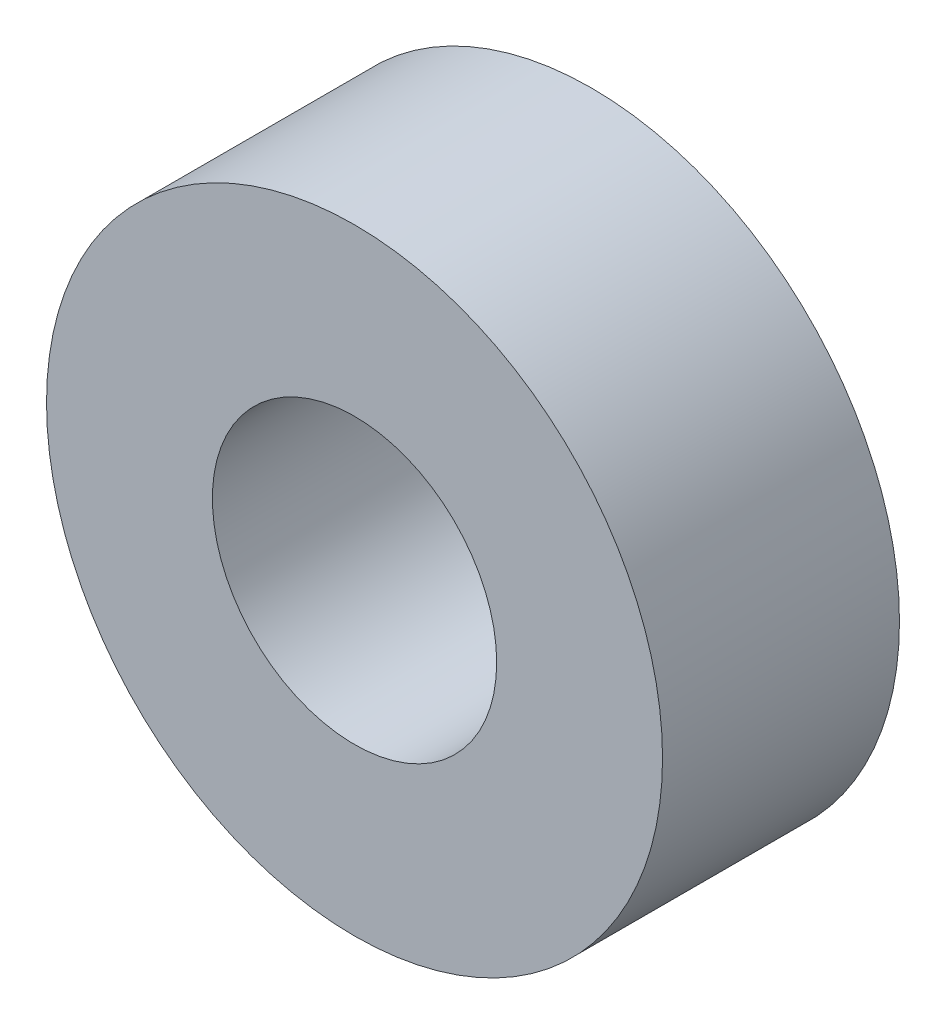
ISO-10303-21;
HEADER;
FILE_DESCRIPTION(('STEP AP214'),'2;1');
FILE_NAME('part.step','',(''),(''),'','','');
FILE_SCHEMA(('AUTOMOTIVE_DESIGN { 1 0 10303 214 1 1 1 1 }'));
ENDSEC;
DATA;
#1=APPLICATION_CONTEXT('core data for automotive mechanical design processes');
#2=APPLICATION_PROTOCOL_DEFINITION('international standard','automotive_design',2000,#1);
#3=PRODUCT_CONTEXT('',#1,'mechanical');
#4=PRODUCT('Part','Part','',(#3));
#5=PRODUCT_RELATED_PRODUCT_CATEGORY('part','',(#4));
#6=PRODUCT_DEFINITION_FORMATION('','',#4);
#7=PRODUCT_DEFINITION_CONTEXT('part definition',#1,'design');
#8=PRODUCT_DEFINITION('design','',#6,#7);
#9=PRODUCT_DEFINITION_SHAPE('','',#8);
#10=(LENGTH_UNIT() NAMED_UNIT(*) SI_UNIT(.MILLI.,.METRE.));
#11=(NAMED_UNIT(*) PLANE_ANGLE_UNIT() SI_UNIT($,.RADIAN.));
#12=(NAMED_UNIT(*) SI_UNIT($,.STERADIAN.) SOLID_ANGLE_UNIT());
#13=UNCERTAINTY_MEASURE_WITH_UNIT(LENGTH_MEASURE(1.E-05),#10,'distance_accuracy_value','');
#14=(GEOMETRIC_REPRESENTATION_CONTEXT(3) GLOBAL_UNCERTAINTY_ASSIGNED_CONTEXT((#13)) GLOBAL_UNIT_ASSIGNED_CONTEXT((#10,
#11,#12)) REPRESENTATION_CONTEXT('',''));
#15=CARTESIAN_POINT('',(0.,0.,0.));
#16=DIRECTION('',(0.,0.,1.));
#17=DIRECTION('',(1.,0.,0.));
#18=AXIS2_PLACEMENT_3D('',#15,#16,#17);
#19=CARTESIAN_POINT('',(0.,0.,15.875));
#20=DIRECTION('',(0.,0.,1.));
#21=DIRECTION('',(1.,0.,0.));
#22=AXIS2_PLACEMENT_3D('',#19,#20,#21);
#23=PLANE('',#22);
#24=CARTESIAN_POINT('',(0.,0.,15.875));
#25=DIRECTION('',(0.,0.,1.));
#26=DIRECTION('',(1.,0.,0.));
#27=AXIS2_PLACEMENT_3D('',#24,#25,#26);
#28=CIRCLE('',#27,20.6375);
#29=CARTESIAN_POINT('',(20.6375,0.,15.875));
#30=VERTEX_POINT('',#29);
#31=EDGE_CURVE('E10',#30,#30,#28,.T.);
#32=ORIENTED_EDGE('',*,*,#31,.T.);
#33=EDGE_LOOP('',(#32));
#34=FACE_BOUND('',#33,.T.);
#35=CARTESIAN_POINT('',(0.,0.,15.875));
#36=DIRECTION('',(0.,0.,1.));
#37=DIRECTION('',(1.,0.,0.));
#38=AXIS2_PLACEMENT_3D('',#35,#36,#37);
#39=CIRCLE('',#38,9.525);
#40=CARTESIAN_POINT('',(9.525,0.,15.875));
#41=VERTEX_POINT('',#40);
#42=EDGE_CURVE('E50',#41,#41,#39,.T.);
#43=ORIENTED_EDGE('',*,*,#42,.F.);
#44=EDGE_LOOP('',(#43));
#45=FACE_BOUND('',#44,.T.);
#46=ADVANCED_FACE('F37',(#34,#45),#23,.T.);
#47=CARTESIAN_POINT('',(0.,0.,0.));
#48=DIRECTION('',(0.,0.,1.));
#49=DIRECTION('',(1.,0.,0.));
#50=AXIS2_PLACEMENT_3D('',#47,#48,#49);
#51=PLANE('',#50);
#52=CARTESIAN_POINT('',(0.,0.,0.));
#53=DIRECTION('',(0.,0.,1.));
#54=DIRECTION('',(1.,0.,0.));
#55=AXIS2_PLACEMENT_3D('',#52,#53,#54);
#56=CIRCLE('',#55,20.6375);
#57=CARTESIAN_POINT('',(20.6375,0.,0.));
#58=VERTEX_POINT('',#57);
#59=EDGE_CURVE('E41',#58,#58,#56,.T.);
#60=ORIENTED_EDGE('',*,*,#59,.F.);
#61=EDGE_LOOP('',(#60));
#62=FACE_BOUND('',#61,.T.);
#63=CARTESIAN_POINT('',(0.,0.,0.));
#64=DIRECTION('',(0.,0.,1.));
#65=DIRECTION('',(1.,0.,0.));
#66=AXIS2_PLACEMENT_3D('',#63,#64,#65);
#67=CIRCLE('',#66,9.525);
#68=CARTESIAN_POINT('',(9.525,0.,0.));
#69=VERTEX_POINT('',#68);
#70=EDGE_CURVE('E52',#69,#69,#67,.T.);
#71=ORIENTED_EDGE('',*,*,#70,.T.);
#72=EDGE_LOOP('',(#71));
#73=FACE_BOUND('',#72,.T.);
#74=ADVANCED_FACE('F64',(#62,#73),#51,.F.);
#75=CARTESIAN_POINT('',(0.,0.,15.875));
#76=DIRECTION('',(0.,0.,-1.));
#77=DIRECTION('',(-1.,0.,0.));
#78=AXIS2_PLACEMENT_3D('',#75,#76,#77);
#79=CYLINDRICAL_SURFACE('',#78,20.6375);
#80=ORIENTED_EDGE('',*,*,#31,.F.);
#81=EDGE_LOOP('',(#80));
#82=FACE_BOUND('',#81,.T.);
#83=ORIENTED_EDGE('',*,*,#59,.T.);
#84=EDGE_LOOP('',(#83));
#85=FACE_BOUND('',#84,.T.);
#86=ADVANCED_FACE('F39',(#82,#85),#79,.T.);
#87=CARTESIAN_POINT('',(0.,0.,15.875));
#88=DIRECTION('',(0.,0.,-1.));
#89=DIRECTION('',(-1.,0.,0.));
#90=AXIS2_PLACEMENT_3D('',#87,#88,#89);
#91=CYLINDRICAL_SURFACE('',#90,9.525);
#92=ORIENTED_EDGE('',*,*,#42,.T.);
#93=EDGE_LOOP('',(#92));
#94=FACE_BOUND('',#93,.T.);
#95=ORIENTED_EDGE('',*,*,#70,.F.);
#96=EDGE_LOOP('',(#95));
#97=FACE_BOUND('',#96,.T.);
#98=ADVANCED_FACE('F60',(#94,#97),#91,.F.);
#99=CLOSED_SHELL('',(#46,#74,#86,#98));
#100=MANIFOLD_SOLID_BREP('B2',#99);
#101=ADVANCED_BREP_SHAPE_REPRESENTATION('',(#18,#100),#14);
#102=SHAPE_DEFINITION_REPRESENTATION(#9,#101);
ENDSEC;
END-ISO-10303-21;
